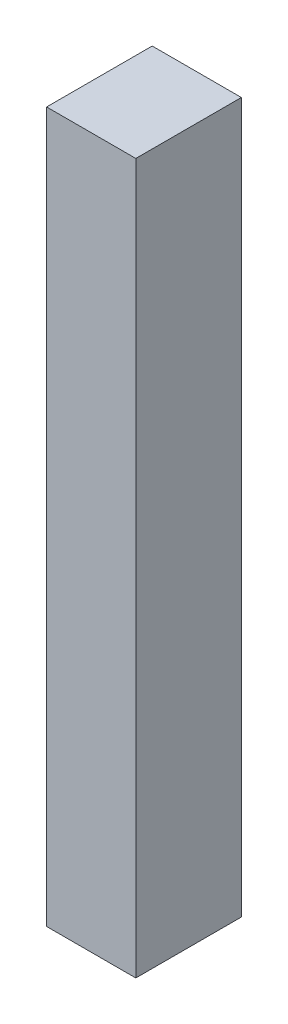
ISO-10303-21;
HEADER;
FILE_DESCRIPTION(('STEP AP214'),'2;1');
FILE_NAME('part.step','',(''),(''),'','','');
FILE_SCHEMA(('AUTOMOTIVE_DESIGN { 1 0 10303 214 1 1 1 1 }'));
ENDSEC;
DATA;
#1=APPLICATION_CONTEXT('core data for automotive mechanical design processes');
#2=APPLICATION_PROTOCOL_DEFINITION('international standard','automotive_design',2000,#1);
#3=PRODUCT_CONTEXT('',#1,'mechanical');
#4=PRODUCT('Part','Part','',(#3));
#5=PRODUCT_RELATED_PRODUCT_CATEGORY('part','',(#4));
#6=PRODUCT_DEFINITION_FORMATION('','',#4);
#7=PRODUCT_DEFINITION_CONTEXT('part definition',#1,'design');
#8=PRODUCT_DEFINITION('design','',#6,#7);
#9=PRODUCT_DEFINITION_SHAPE('','',#8);
#10=(LENGTH_UNIT() NAMED_UNIT(*) SI_UNIT(.MILLI.,.METRE.));
#11=(NAMED_UNIT(*) PLANE_ANGLE_UNIT() SI_UNIT($,.RADIAN.));
#12=(NAMED_UNIT(*) SI_UNIT($,.STERADIAN.) SOLID_ANGLE_UNIT());
#13=UNCERTAINTY_MEASURE_WITH_UNIT(LENGTH_MEASURE(1.E-05),#10,'distance_accuracy_value','');
#14=(GEOMETRIC_REPRESENTATION_CONTEXT(3) GLOBAL_UNCERTAINTY_ASSIGNED_CONTEXT((#13)) GLOBAL_UNIT_ASSIGNED_CONTEXT((#10,
#11,#12)) REPRESENTATION_CONTEXT('',''));
#15=CARTESIAN_POINT('',(0.,0.,0.));
#16=DIRECTION('',(0.,0.,1.));
#17=DIRECTION('',(1.,0.,0.));
#18=AXIS2_PLACEMENT_3D('',#15,#16,#17);
#19=CARTESIAN_POINT('',(0.62500002,-4.97499894,1.47999958));
#20=DIRECTION('',(0.,0.,-1.));
#21=DIRECTION('',(0.,-1.,0.));
#22=AXIS2_PLACEMENT_3D('',#19,#20,#21);
#23=PLANE('',#22);
#24=DIRECTION('',(0.,1.,0.));
#25=VECTOR('',#24,1.);
#26=CARTESIAN_POINT('',(0.62500002,-4.97499894,1.47999958));
#27=LINE('',#26,#25);
#28=CARTESIAN_POINT('',(0.62500002,-4.97499894,1.47999958));
#29=VERTEX_POINT('',#28);
#30=CARTESIAN_POINT('',(0.62500002,4.97499894,1.47999958));
#31=VERTEX_POINT('',#30);
#32=EDGE_CURVE('E92',#29,#31,#27,.T.);
#33=ORIENTED_EDGE('',*,*,#32,.T.);
#34=DIRECTION('',(-1.,0.,0.));
#35=VECTOR('',#34,1.);
#36=CARTESIAN_POINT('',(0.62500002,4.97499894,1.47999958));
#37=LINE('',#36,#35);
#38=CARTESIAN_POINT('',(-0.62500002,4.97499894,1.47999958));
#39=VERTEX_POINT('',#38);
#40=EDGE_CURVE('E88',#31,#39,#37,.T.);
#41=ORIENTED_EDGE('',*,*,#40,.T.);
#42=DIRECTION('',(0.,-1.,0.));
#43=VECTOR('',#42,1.);
#44=CARTESIAN_POINT('',(-0.62500002,4.97499894,1.47999958));
#45=LINE('',#44,#43);
#46=CARTESIAN_POINT('',(-0.62500002,-4.97499894,1.47999958));
#47=VERTEX_POINT('',#46);
#48=EDGE_CURVE('E104',#39,#47,#45,.T.);
#49=ORIENTED_EDGE('',*,*,#48,.T.);
#50=DIRECTION('',(1.,0.,0.));
#51=VECTOR('',#50,1.);
#52=CARTESIAN_POINT('',(-0.62500002,-4.97499894,1.47999958));
#53=LINE('',#52,#51);
#54=EDGE_CURVE('E10',#47,#29,#53,.T.);
#55=ORIENTED_EDGE('',*,*,#54,.T.);
#56=EDGE_LOOP('',(#33,#41,#49,#55));
#57=FACE_BOUND('',#56,.T.);
#58=ADVANCED_FACE('F16',(#57),#23,.F.);
#59=CARTESIAN_POINT('',(0.62500002,-4.97499894,0.));
#60=DIRECTION('',(0.,0.,-1.));
#61=DIRECTION('',(0.,-1.,0.));
#62=AXIS2_PLACEMENT_3D('',#59,#60,#61);
#63=PLANE('',#62);
#64=DIRECTION('',(1.,0.,0.));
#65=VECTOR('',#64,1.);
#66=CARTESIAN_POINT('',(-0.62500002,-4.97499894,0.));
#67=LINE('',#66,#65);
#68=CARTESIAN_POINT('',(-0.62500002,-4.97499894,0.));
#69=VERTEX_POINT('',#68);
#70=CARTESIAN_POINT('',(0.62500002,-4.97499894,0.));
#71=VERTEX_POINT('',#70);
#72=EDGE_CURVE('E27',#69,#71,#67,.T.);
#73=ORIENTED_EDGE('',*,*,#72,.F.);
#74=DIRECTION('',(0.,-1.,0.));
#75=VECTOR('',#74,1.);
#76=CARTESIAN_POINT('',(-0.62500002,4.97499894,0.));
#77=LINE('',#76,#75);
#78=CARTESIAN_POINT('',(-0.62500002,4.97499894,0.));
#79=VERTEX_POINT('',#78);
#80=EDGE_CURVE('E68',#79,#69,#77,.T.);
#81=ORIENTED_EDGE('',*,*,#80,.F.);
#82=DIRECTION('',(-1.,0.,0.));
#83=VECTOR('',#82,1.);
#84=CARTESIAN_POINT('',(0.62500002,4.97499894,0.));
#85=LINE('',#84,#83);
#86=CARTESIAN_POINT('',(0.62500002,4.97499894,0.));
#87=VERTEX_POINT('',#86);
#88=EDGE_CURVE('E74',#87,#79,#85,.T.);
#89=ORIENTED_EDGE('',*,*,#88,.F.);
#90=DIRECTION('',(0.,1.,0.));
#91=VECTOR('',#90,1.);
#92=CARTESIAN_POINT('',(0.62500002,-4.97499894,0.));
#93=LINE('',#92,#91);
#94=EDGE_CURVE('E78',#71,#87,#93,.T.);
#95=ORIENTED_EDGE('',*,*,#94,.F.);
#96=EDGE_LOOP('',(#73,#81,#89,#95));
#97=FACE_BOUND('',#96,.T.);
#98=ADVANCED_FACE('F76',(#97),#63,.T.);
#99=CARTESIAN_POINT('',(-0.62500002,-4.97499894,0.));
#100=DIRECTION('',(0.,1.,0.));
#101=DIRECTION('',(1.,0.,0.));
#102=AXIS2_PLACEMENT_3D('',#99,#100,#101);
#103=PLANE('',#102);
#104=ORIENTED_EDGE('',*,*,#72,.T.);
#105=DIRECTION('',(0.,0.,1.));
#106=VECTOR('',#105,1.);
#107=CARTESIAN_POINT('',(0.62500002,-4.97499894,0.));
#108=LINE('',#107,#106);
#109=EDGE_CURVE('E82',#71,#29,#108,.T.);
#110=ORIENTED_EDGE('',*,*,#109,.T.);
#111=ORIENTED_EDGE('',*,*,#54,.F.);
#112=DIRECTION('',(0.,0.,1.));
#113=VECTOR('',#112,1.);
#114=CARTESIAN_POINT('',(-0.62500002,-4.97499894,0.));
#115=LINE('',#114,#113);
#116=EDGE_CURVE('E101',#69,#47,#115,.T.);
#117=ORIENTED_EDGE('',*,*,#116,.F.);
#118=EDGE_LOOP('',(#104,#110,#111,#117));
#119=FACE_BOUND('',#118,.T.);
#120=ADVANCED_FACE('F183',(#119),#103,.F.);
#121=CARTESIAN_POINT('',(-0.62500002,4.97499894,0.));
#122=DIRECTION('',(1.,0.,0.));
#123=DIRECTION('',(0.,1.,0.));
#124=AXIS2_PLACEMENT_3D('',#121,#122,#123);
#125=PLANE('',#124);
#126=ORIENTED_EDGE('',*,*,#80,.T.);
#127=ORIENTED_EDGE('',*,*,#116,.T.);
#128=ORIENTED_EDGE('',*,*,#48,.F.);
#129=DIRECTION('',(0.,0.,1.));
#130=VECTOR('',#129,1.);
#131=CARTESIAN_POINT('',(-0.62500002,4.97499894,0.));
#132=LINE('',#131,#130);
#133=EDGE_CURVE('E20',#79,#39,#132,.T.);
#134=ORIENTED_EDGE('',*,*,#133,.F.);
#135=EDGE_LOOP('',(#126,#127,#128,#134));
#136=FACE_BOUND('',#135,.T.);
#137=ADVANCED_FACE('F18',(#136),#125,.F.);
#138=CARTESIAN_POINT('',(0.62500002,4.97499894,0.));
#139=DIRECTION('',(0.,-1.,0.));
#140=DIRECTION('',(0.,0.,-1.));
#141=AXIS2_PLACEMENT_3D('',#138,#139,#140);
#142=PLANE('',#141);
#143=ORIENTED_EDGE('',*,*,#88,.T.);
#144=ORIENTED_EDGE('',*,*,#133,.T.);
#145=ORIENTED_EDGE('',*,*,#40,.F.);
#146=DIRECTION('',(0.,0.,1.));
#147=VECTOR('',#146,1.);
#148=CARTESIAN_POINT('',(0.62500002,4.97499894,0.));
#149=LINE('',#148,#147);
#150=EDGE_CURVE('E85',#87,#31,#149,.T.);
#151=ORIENTED_EDGE('',*,*,#150,.F.);
#152=EDGE_LOOP('',(#143,#144,#145,#151));
#153=FACE_BOUND('',#152,.T.);
#154=ADVANCED_FACE('F86',(#153),#142,.F.);
#155=CARTESIAN_POINT('',(0.62500002,-4.97499894,0.));
#156=DIRECTION('',(-1.,0.,0.));
#157=DIRECTION('',(0.,0.,1.));
#158=AXIS2_PLACEMENT_3D('',#155,#156,#157);
#159=PLANE('',#158);
#160=ORIENTED_EDGE('',*,*,#94,.T.);
#161=ORIENTED_EDGE('',*,*,#150,.T.);
#162=ORIENTED_EDGE('',*,*,#32,.F.);
#163=ORIENTED_EDGE('',*,*,#109,.F.);
#164=EDGE_LOOP('',(#160,#161,#162,#163));
#165=FACE_BOUND('',#164,.T.);
#166=ADVANCED_FACE('F95',(#165),#159,.F.);
#167=CLOSED_SHELL('',(#58,#98,#120,#137,#154,#166));
#168=MANIFOLD_SOLID_BREP('B1',#167);
#169=ADVANCED_BREP_SHAPE_REPRESENTATION('',(#18,#168),#14);
#170=SHAPE_DEFINITION_REPRESENTATION(#9,#169);
ENDSEC;
END-ISO-10303-21;
